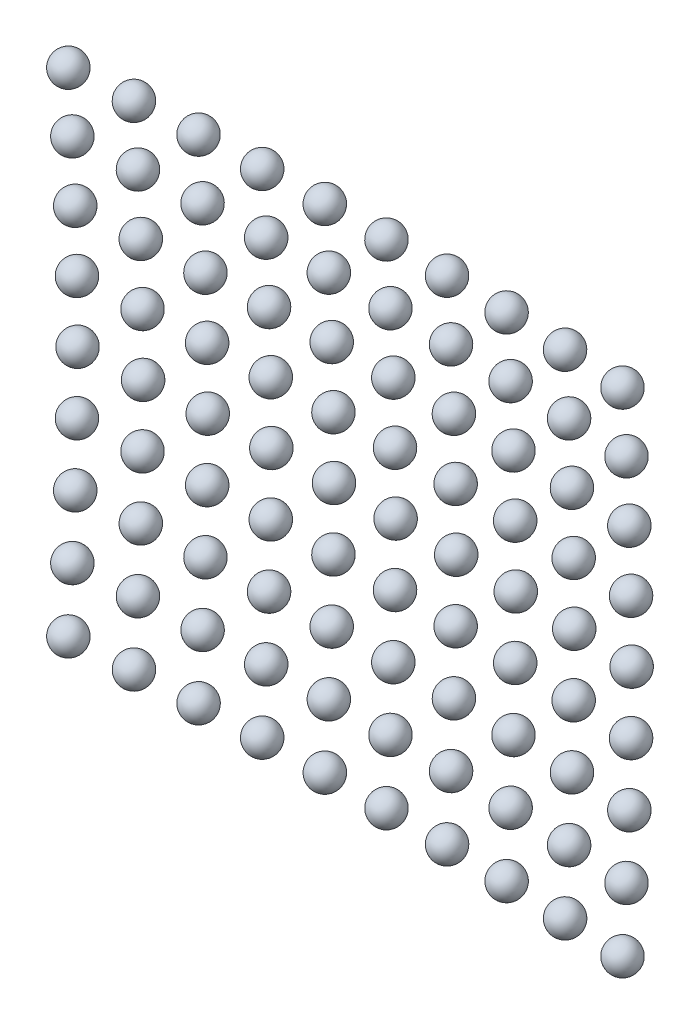
ISO-10303-21;
HEADER;
FILE_DESCRIPTION(('STEP AP214'),'2;1');
FILE_NAME('part.step','',(''),(''),'','','');
FILE_SCHEMA(('AUTOMOTIVE_DESIGN { 1 0 10303 214 1 1 1 1 }'));
ENDSEC;
DATA;
#1=APPLICATION_CONTEXT('core data for automotive mechanical design processes');
#2=APPLICATION_PROTOCOL_DEFINITION('international standard','automotive_design',2000,#1);
#3=PRODUCT_CONTEXT('',#1,'mechanical');
#4=PRODUCT('Part','Part','',(#3));
#5=PRODUCT_RELATED_PRODUCT_CATEGORY('part','',(#4));
#6=PRODUCT_DEFINITION_FORMATION('','',#4);
#7=PRODUCT_DEFINITION_CONTEXT('part definition',#1,'design');
#8=PRODUCT_DEFINITION('design','',#6,#7);
#9=PRODUCT_DEFINITION_SHAPE('','',#8);
#10=(LENGTH_UNIT() NAMED_UNIT(*) SI_UNIT(.MILLI.,.METRE.));
#11=(NAMED_UNIT(*) PLANE_ANGLE_UNIT() SI_UNIT($,.RADIAN.));
#12=(NAMED_UNIT(*) SI_UNIT($,.STERADIAN.) SOLID_ANGLE_UNIT());
#13=UNCERTAINTY_MEASURE_WITH_UNIT(LENGTH_MEASURE(1.E-05),#10,'distance_accuracy_value','');
#14=(GEOMETRIC_REPRESENTATION_CONTEXT(3) GLOBAL_UNCERTAINTY_ASSIGNED_CONTEXT((#13)) GLOBAL_UNIT_ASSIGNED_CONTEXT((#10,
#11,#12)) REPRESENTATION_CONTEXT('',''));
#15=CARTESIAN_POINT('',(0.,0.,0.));
#16=DIRECTION('',(0.,0.,1.));
#17=DIRECTION('',(1.,0.,0.));
#18=AXIS2_PLACEMENT_3D('',#15,#16,#17);
#19=CARTESIAN_POINT('',(8.00817179263602,-8.9214419487475,0.747647017793937));
#20=DIRECTION('',(0.,0.,-1.));
#21=DIRECTION('',(0.,-1.,0.));
#22=AXIS2_PLACEMENT_3D('',#19,#20,#21);
#23=SPHERICAL_SURFACE('',#22,0.5);
#24=CARTESIAN_POINT('',(8.00817179263602,-8.9214419487475,0.247647017793937));
#25=VERTEX_POINT('',#24);
#26=VERTEX_LOOP('',#25);
#27=FACE_BOUND('',#26,.T.);
#28=ADVANCED_FACE('F41',(#27),#23,.T.);
#29=CLOSED_SHELL('',(#28));
#30=MANIFOLD_SOLID_BREP('B2',#29);
#31=CARTESIAN_POINT('',(6.01259338943925,-8.9214419487475,0.615076387186788));
#32=DIRECTION('',(0.,0.,-1.));
#33=DIRECTION('',(0.,-1.,0.));
#34=AXIS2_PLACEMENT_3D('',#31,#32,#33);
#35=SPHERICAL_SURFACE('',#34,0.5);
#36=CARTESIAN_POINT('',(6.01259338943925,-8.9214419487475,0.115076387186788));
#37=VERTEX_POINT('',#36);
#38=VERTEX_LOOP('',#37);
#39=FACE_BOUND('',#38,.T.);
#40=ADVANCED_FACE('F61',(#39),#35,.T.);
#41=CLOSED_SHELL('',(#40));
#42=MANIFOLD_SOLID_BREP('B6',#41);
#43=CARTESIAN_POINT('',(4.01508925056326,-8.9214419487475,0.515651286844554));
#44=DIRECTION('',(0.,0.,-1.));
#45=DIRECTION('',(0.,-1.,0.));
#46=AXIS2_PLACEMENT_3D('',#43,#44,#45);
#47=SPHERICAL_SURFACE('',#46,0.5);
#48=CARTESIAN_POINT('',(4.01508925056326,-8.9214419487475,0.0156512868445537));
#49=VERTEX_POINT('',#48);
#50=VERTEX_LOOP('',#49);
#51=FACE_BOUND('',#50,.T.);
#52=ADVANCED_FACE('F81',(#51),#47,.T.);
#53=CLOSED_SHELL('',(#52));
#54=MANIFOLD_SOLID_BREP('B37',#53);
#55=CARTESIAN_POINT('',(2.01620986814937,-8.9214419487475,0.449399117329413));
#56=DIRECTION('',(0.,0.,-1.));
#57=DIRECTION('',(0.,-1.,0.));
#58=AXIS2_PLACEMENT_3D('',#55,#56,#57);
#59=SPHERICAL_SURFACE('',#58,0.5);
#60=CARTESIAN_POINT('',(2.01620986814937,-8.9214419487475,-0.0506008826705871));
#61=VERTEX_POINT('',#60);
#62=VERTEX_LOOP('',#61);
#63=FACE_BOUND('',#62,.T.);
#64=ADVANCED_FACE('F101',(#63),#59,.T.);
#65=CLOSED_SHELL('',(#64));
#66=MANIFOLD_SOLID_BREP('B57',#65);
#67=CARTESIAN_POINT('',(0.0165061133422777,-8.9214419487475,0.416338137075991));
#68=DIRECTION('',(0.,0.,-1.));
#69=DIRECTION('',(0.,-1.,0.));
#70=AXIS2_PLACEMENT_3D('',#67,#68,#69);
#71=SPHERICAL_SURFACE('',#70,0.5);
#72=CARTESIAN_POINT('',(0.0165061133422777,-8.9214419487475,-0.0836618629240086));
#73=VERTEX_POINT('',#72);
#74=VERTEX_LOOP('',#73);
#75=FACE_BOUND('',#74,.T.);
#76=ADVANCED_FACE('F121',(#75),#71,.T.);
#77=CLOSED_SHELL('',(#76));
#78=MANIFOLD_SOLID_BREP('B77',#77);
#79=CARTESIAN_POINT('',(-1.98347091552447,-8.9214419487475,0.416477457359412));
#80=DIRECTION('',(0.,0.,-1.));
#81=DIRECTION('',(0.,-1.,0.));
#82=AXIS2_PLACEMENT_3D('',#79,#80,#81);
#83=SPHERICAL_SURFACE('',#82,0.5);
#84=CARTESIAN_POINT('',(-1.98347091552447,-8.9214419487475,-0.0835225426405876));
#85=VERTEX_POINT('',#84);
#86=VERTEX_LOOP('',#85);
#87=FACE_BOUND('',#86,.T.);
#88=ADVANCED_FACE('F141',(#87),#83,.T.);
#89=CLOSED_SHELL('',(#88));
#90=MANIFOLD_SOLID_BREP('B97',#89);
#91=CARTESIAN_POINT('',(-3.98317004480583,-8.9214419487475,0.449817039784403));
#92=DIRECTION('',(0.,0.,-1.));
#93=DIRECTION('',(0.,-1.,0.));
#94=AXIS2_PLACEMENT_3D('',#91,#92,#93);
#95=SPHERICAL_SURFACE('',#94,0.5);
#96=CARTESIAN_POINT('',(-3.98317004480583,-8.9214419487475,-0.0501829602155971));
#97=VERTEX_POINT('',#96);
#98=VERTEX_LOOP('',#97);
#99=FACE_BOUND('',#98,.T.);
#100=ADVANCED_FACE('F161',(#99),#95,.T.);
#101=CLOSED_SHELL('',(#100));
#102=MANIFOLD_SOLID_BREP('B117',#101);
#103=CARTESIAN_POINT('',(-5.982040177443,-8.9214419487475,0.516347696295841));
#104=DIRECTION('',(0.,0.,-1.));
#105=DIRECTION('',(0.,-1.,0.));
#106=AXIS2_PLACEMENT_3D('',#103,#104,#105);
#107=SPHERICAL_SURFACE('',#106,0.5);
#108=CARTESIAN_POINT('',(-5.982040177443,-8.9214419487475,0.0163476962958405));
#109=VERTEX_POINT('',#108);
#110=VERTEX_LOOP('',#109);
#111=FACE_BOUND('',#110,.T.);
#112=ADVANCED_FACE('F181',(#111),#107,.T.);
#113=CLOSED_SHELL('',(#112));
#114=MANIFOLD_SOLID_BREP('B137',#113);
#115=CARTESIAN_POINT('',(-7.97953044484047,-8.9214419487475,0.616051091710923));
#116=DIRECTION('',(0.,0.,-1.));
#117=DIRECTION('',(0.,-1.,0.));
#118=AXIS2_PLACEMENT_3D('',#115,#116,#117);
#119=SPHERICAL_SURFACE('',#118,0.5);
#120=CARTESIAN_POINT('',(-7.97953044484047,-8.9214419487475,0.116051091710923));
#121=VERTEX_POINT('',#120);
#122=VERTEX_LOOP('',#121);
#123=FACE_BOUND('',#122,.T.);
#124=ADVANCED_FACE('F201',(#123),#119,.T.);
#125=CLOSED_SHELL('',(#124));
#126=MANIFOLD_SOLID_BREP('B157',#125);
#127=CARTESIAN_POINT('',(-9.97509035867965,-8.9214419487475,0.748899748772111));
#128=DIRECTION('',(0.,0.,-1.));
#129=DIRECTION('',(0.,-1.,0.));
#130=AXIS2_PLACEMENT_3D('',#127,#128,#129);
#131=SPHERICAL_SURFACE('',#130,0.5);
#132=CARTESIAN_POINT('',(-9.97509035867965,-8.9214419487475,0.248899748772111));
#133=VERTEX_POINT('',#132);
#134=VERTEX_LOOP('',#133);
#135=FACE_BOUND('',#134,.T.);
#136=ADVANCED_FACE('F221',(#135),#131,.T.);
#137=CLOSED_SHELL('',(#136));
#138=MANIFOLD_SOLID_BREP('B177',#137);
#139=CARTESIAN_POINT('',(8.00817179263602,-6.92569907133099,0.617666145492551));
#140=DIRECTION('',(0.,0.,-1.));
#141=DIRECTION('',(0.,-1.,0.));
#142=AXIS2_PLACEMENT_3D('',#139,#140,#141);
#143=SPHERICAL_SURFACE('',#142,0.5);
#144=CARTESIAN_POINT('',(8.00817179263602,-6.92569907133099,0.117666145492551));
#145=VERTEX_POINT('',#144);
#146=VERTEX_LOOP('',#145);
#147=FACE_BOUND('',#146,.T.);
#148=ADVANCED_FACE('F241',(#147),#143,.T.);
#149=CLOSED_SHELL('',(#148));
#150=MANIFOLD_SOLID_BREP('B197',#149);
#151=CARTESIAN_POINT('',(6.01259338943925,-6.92569907133099,0.485095514885403));
#152=DIRECTION('',(0.,0.,-1.));
#153=DIRECTION('',(0.,-1.,0.));
#154=AXIS2_PLACEMENT_3D('',#151,#152,#153);
#155=SPHERICAL_SURFACE('',#154,0.5);
#156=CARTESIAN_POINT('',(6.01259338943925,-6.92569907133099,-0.0149044851145972));
#157=VERTEX_POINT('',#156);
#158=VERTEX_LOOP('',#157);
#159=FACE_BOUND('',#158,.T.);
#160=ADVANCED_FACE('F261',(#159),#155,.T.);
#161=CLOSED_SHELL('',(#160));
#162=MANIFOLD_SOLID_BREP('B217',#161);
#163=CARTESIAN_POINT('',(4.01508925056326,-6.92569907133099,0.385670414543168));
#164=DIRECTION('',(0.,0.,-1.));
#165=DIRECTION('',(0.,-1.,0.));
#166=AXIS2_PLACEMENT_3D('',#163,#164,#165);
#167=SPHERICAL_SURFACE('',#166,0.5);
#168=CARTESIAN_POINT('',(4.01508925056326,-6.92569907133099,-0.114329585456832));
#169=VERTEX_POINT('',#168);
#170=VERTEX_LOOP('',#169);
#171=FACE_BOUND('',#170,.T.);
#172=ADVANCED_FACE('F281',(#171),#167,.T.);
#173=CLOSED_SHELL('',(#172));
#174=MANIFOLD_SOLID_BREP('B237',#173);
#175=CARTESIAN_POINT('',(2.01620986814937,-6.92569907133099,0.319418245028027));
#176=DIRECTION('',(0.,0.,-1.));
#177=DIRECTION('',(0.,-1.,0.));
#178=AXIS2_PLACEMENT_3D('',#175,#176,#177);
#179=SPHERICAL_SURFACE('',#178,0.5);
#180=CARTESIAN_POINT('',(2.01620986814937,-6.92569907133099,-0.180581754971973));
#181=VERTEX_POINT('',#180);
#182=VERTEX_LOOP('',#181);
#183=FACE_BOUND('',#182,.T.);
#184=ADVANCED_FACE('F301',(#183),#179,.T.);
#185=CLOSED_SHELL('',(#184));
#186=MANIFOLD_SOLID_BREP('B257',#185);
#187=CARTESIAN_POINT('',(0.0165061133422777,-6.92569907133099,0.286357264774606));
#188=DIRECTION('',(0.,0.,-1.));
#189=DIRECTION('',(0.,-1.,0.));
#190=AXIS2_PLACEMENT_3D('',#187,#188,#189);
#191=SPHERICAL_SURFACE('',#190,0.5);
#192=CARTESIAN_POINT('',(0.0165061133422777,-6.92569907133099,-0.213642735225394));
#193=VERTEX_POINT('',#192);
#194=VERTEX_LOOP('',#193);
#195=FACE_BOUND('',#194,.T.);
#196=ADVANCED_FACE('F321',(#195),#191,.T.);
#197=CLOSED_SHELL('',(#196));
#198=MANIFOLD_SOLID_BREP('B277',#197);
#199=CARTESIAN_POINT('',(-1.98347091552447,-6.92569907133099,0.286496585058027));
#200=DIRECTION('',(0.,0.,-1.));
#201=DIRECTION('',(0.,-1.,0.));
#202=AXIS2_PLACEMENT_3D('',#199,#200,#201);
#203=SPHERICAL_SURFACE('',#202,0.5);
#204=CARTESIAN_POINT('',(-1.98347091552447,-6.92569907133099,-0.213503414941973));
#205=VERTEX_POINT('',#204);
#206=VERTEX_LOOP('',#205);
#207=FACE_BOUND('',#206,.T.);
#208=ADVANCED_FACE('F341',(#207),#203,.T.);
#209=CLOSED_SHELL('',(#208));
#210=MANIFOLD_SOLID_BREP('B297',#209);
#211=CARTESIAN_POINT('',(-3.98317004480583,-6.92569907133099,0.319836167483017));
#212=DIRECTION('',(0.,0.,-1.));
#213=DIRECTION('',(0.,-1.,0.));
#214=AXIS2_PLACEMENT_3D('',#211,#212,#213);
#215=SPHERICAL_SURFACE('',#214,0.5);
#216=CARTESIAN_POINT('',(-3.98317004480583,-6.92569907133099,-0.180163832516983));
#217=VERTEX_POINT('',#216);
#218=VERTEX_LOOP('',#217);
#219=FACE_BOUND('',#218,.T.);
#220=ADVANCED_FACE('F361',(#219),#215,.T.);
#221=CLOSED_SHELL('',(#220));
#222=MANIFOLD_SOLID_BREP('B317',#221);
#223=CARTESIAN_POINT('',(-5.982040177443,-6.92569907133099,0.386366823994455));
#224=DIRECTION('',(0.,0.,-1.));
#225=DIRECTION('',(0.,-1.,0.));
#226=AXIS2_PLACEMENT_3D('',#223,#224,#225);
#227=SPHERICAL_SURFACE('',#226,0.5);
#228=CARTESIAN_POINT('',(-5.982040177443,-6.92569907133099,-0.113633176005545));
#229=VERTEX_POINT('',#228);
#230=VERTEX_LOOP('',#229);
#231=FACE_BOUND('',#230,.T.);
#232=ADVANCED_FACE('F381',(#231),#227,.T.);
#233=CLOSED_SHELL('',(#232));
#234=MANIFOLD_SOLID_BREP('B337',#233);
#235=CARTESIAN_POINT('',(-7.97953044484047,-6.92569907133099,0.486070219409537));
#236=DIRECTION('',(0.,0.,-1.));
#237=DIRECTION('',(0.,-1.,0.));
#238=AXIS2_PLACEMENT_3D('',#235,#236,#237);
#239=SPHERICAL_SURFACE('',#238,0.5);
#240=CARTESIAN_POINT('',(-7.97953044484047,-6.92569907133099,-0.0139297805904629));
#241=VERTEX_POINT('',#240);
#242=VERTEX_LOOP('',#241);
#243=FACE_BOUND('',#242,.T.);
#244=ADVANCED_FACE('F401',(#243),#239,.T.);
#245=CLOSED_SHELL('',(#244));
#246=MANIFOLD_SOLID_BREP('B357',#245);
#247=CARTESIAN_POINT('',(-9.97509035867965,-6.92569907133099,0.618918876470725));
#248=DIRECTION('',(0.,0.,-1.));
#249=DIRECTION('',(0.,-1.,0.));
#250=AXIS2_PLACEMENT_3D('',#247,#248,#249);
#251=SPHERICAL_SURFACE('',#250,0.5);
#252=CARTESIAN_POINT('',(-9.97509035867965,-6.92569907133099,0.118918876470725));
#253=VERTEX_POINT('',#252);
#254=VERTEX_LOOP('',#253);
#255=FACE_BOUND('',#254,.T.);
#256=ADVANCED_FACE('F421',(#255),#251,.T.);
#257=CLOSED_SHELL('',(#256));
#258=MANIFOLD_SOLID_BREP('B377',#257);
#259=CARTESIAN_POINT('',(8.00817179263602,-4.92788374246977,0.524829882696809));
#260=DIRECTION('',(0.,0.,-1.));
#261=DIRECTION('',(0.,-1.,0.));
#262=AXIS2_PLACEMENT_3D('',#259,#260,#261);
#263=SPHERICAL_SURFACE('',#262,0.5);
#264=CARTESIAN_POINT('',(8.00817179263602,-4.92788374246977,0.0248298826968087));
#265=VERTEX_POINT('',#264);
#266=VERTEX_LOOP('',#265);
#267=FACE_BOUND('',#266,.T.);
#268=ADVANCED_FACE('F441',(#267),#263,.T.);
#269=CLOSED_SHELL('',(#268));
#270=MANIFOLD_SOLID_BREP('B397',#269);
#271=CARTESIAN_POINT('',(6.01259338943925,-4.92788374246977,0.39225925208966));
#272=DIRECTION('',(0.,0.,-1.));
#273=DIRECTION('',(0.,-1.,0.));
#274=AXIS2_PLACEMENT_3D('',#271,#272,#273);
#275=SPHERICAL_SURFACE('',#274,0.5);
#276=CARTESIAN_POINT('',(6.01259338943925,-4.92788374246977,-0.10774074791034));
#277=VERTEX_POINT('',#276);
#278=VERTEX_LOOP('',#277);
#279=FACE_BOUND('',#278,.T.);
#280=ADVANCED_FACE('F461',(#279),#275,.T.);
#281=CLOSED_SHELL('',(#280));
#282=MANIFOLD_SOLID_BREP('B417',#281);
#283=CARTESIAN_POINT('',(4.01508925056326,-4.92788374246977,0.292834151747426));
#284=DIRECTION('',(0.,0.,-1.));
#285=DIRECTION('',(0.,-1.,0.));
#286=AXIS2_PLACEMENT_3D('',#283,#284,#285);
#287=SPHERICAL_SURFACE('',#286,0.5);
#288=CARTESIAN_POINT('',(4.01508925056326,-4.92788374246977,-0.207165848252574));
#289=VERTEX_POINT('',#288);
#290=VERTEX_LOOP('',#289);
#291=FACE_BOUND('',#290,.T.);
#292=ADVANCED_FACE('F481',(#291),#287,.T.);
#293=CLOSED_SHELL('',(#292));
#294=MANIFOLD_SOLID_BREP('B437',#293);
#295=CARTESIAN_POINT('',(2.01620986814937,-4.92788374246977,0.226581982232285));
#296=DIRECTION('',(0.,0.,-1.));
#297=DIRECTION('',(0.,-1.,0.));
#298=AXIS2_PLACEMENT_3D('',#295,#296,#297);
#299=SPHERICAL_SURFACE('',#298,0.5);
#300=CARTESIAN_POINT('',(2.01620986814937,-4.92788374246977,-0.273418017767715));
#301=VERTEX_POINT('',#300);
#302=VERTEX_LOOP('',#301);
#303=FACE_BOUND('',#302,.T.);
#304=ADVANCED_FACE('F501',(#303),#299,.T.);
#305=CLOSED_SHELL('',(#304));
#306=MANIFOLD_SOLID_BREP('B457',#305);
#307=CARTESIAN_POINT('',(0.0165061133422777,-4.92788374246977,0.193521001978863));
#308=DIRECTION('',(0.,0.,-1.));
#309=DIRECTION('',(0.,-1.,0.));
#310=AXIS2_PLACEMENT_3D('',#307,#308,#309);
#311=SPHERICAL_SURFACE('',#310,0.5);
#312=CARTESIAN_POINT('',(0.0165061133422777,-4.92788374246977,-0.306478998021137));
#313=VERTEX_POINT('',#312);
#314=VERTEX_LOOP('',#313);
#315=FACE_BOUND('',#314,.T.);
#316=ADVANCED_FACE('F521',(#315),#311,.T.);
#317=CLOSED_SHELL('',(#316));
#318=MANIFOLD_SOLID_BREP('B477',#317);
#319=CARTESIAN_POINT('',(-1.98347091552447,-4.92788374246977,0.193660322262284));
#320=DIRECTION('',(0.,0.,-1.));
#321=DIRECTION('',(0.,-1.,0.));
#322=AXIS2_PLACEMENT_3D('',#319,#320,#321);
#323=SPHERICAL_SURFACE('',#322,0.5);
#324=CARTESIAN_POINT('',(-1.98347091552447,-4.92788374246977,-0.306339677737716));
#325=VERTEX_POINT('',#324);
#326=VERTEX_LOOP('',#325);
#327=FACE_BOUND('',#326,.T.);
#328=ADVANCED_FACE('F541',(#327),#323,.T.);
#329=CLOSED_SHELL('',(#328));
#330=MANIFOLD_SOLID_BREP('B497',#329);
#331=CARTESIAN_POINT('',(-3.98317004480583,-4.92788374246977,0.226999904687275));
#332=DIRECTION('',(0.,0.,-1.));
#333=DIRECTION('',(0.,-1.,0.));
#334=AXIS2_PLACEMENT_3D('',#331,#332,#333);
#335=SPHERICAL_SURFACE('',#334,0.5);
#336=CARTESIAN_POINT('',(-3.98317004480583,-4.92788374246977,-0.273000095312725));
#337=VERTEX_POINT('',#336);
#338=VERTEX_LOOP('',#337);
#339=FACE_BOUND('',#338,.T.);
#340=ADVANCED_FACE('F561',(#339),#335,.T.);
#341=CLOSED_SHELL('',(#340));
#342=MANIFOLD_SOLID_BREP('B517',#341);
#343=CARTESIAN_POINT('',(-5.982040177443,-4.92788374246977,0.293530561198712));
#344=DIRECTION('',(0.,0.,-1.));
#345=DIRECTION('',(0.,-1.,0.));
#346=AXIS2_PLACEMENT_3D('',#343,#344,#345);
#347=SPHERICAL_SURFACE('',#346,0.5);
#348=CARTESIAN_POINT('',(-5.982040177443,-4.92788374246977,-0.206469438801288));
#349=VERTEX_POINT('',#348);
#350=VERTEX_LOOP('',#349);
#351=FACE_BOUND('',#350,.T.);
#352=ADVANCED_FACE('F581',(#351),#347,.T.);
#353=CLOSED_SHELL('',(#352));
#354=MANIFOLD_SOLID_BREP('B537',#353);
#355=CARTESIAN_POINT('',(-7.97953044484047,-4.92788374246977,0.393233956613795));
#356=DIRECTION('',(0.,0.,-1.));
#357=DIRECTION('',(0.,-1.,0.));
#358=AXIS2_PLACEMENT_3D('',#355,#356,#357);
#359=SPHERICAL_SURFACE('',#358,0.5);
#360=CARTESIAN_POINT('',(-7.97953044484047,-4.92788374246977,-0.106766043386205));
#361=VERTEX_POINT('',#360);
#362=VERTEX_LOOP('',#361);
#363=FACE_BOUND('',#362,.T.);
#364=ADVANCED_FACE('F601',(#363),#359,.T.);
#365=CLOSED_SHELL('',(#364));
#366=MANIFOLD_SOLID_BREP('B557',#365);
#367=CARTESIAN_POINT('',(-9.97509035867965,-4.92788374246977,0.526082613674983));
#368=DIRECTION('',(0.,0.,-1.));
#369=DIRECTION('',(0.,-1.,0.));
#370=AXIS2_PLACEMENT_3D('',#367,#368,#369);
#371=SPHERICAL_SURFACE('',#370,0.5);
#372=CARTESIAN_POINT('',(-9.97509035867965,-4.92788374246977,0.0260826136749828));
#373=VERTEX_POINT('',#372);
#374=VERTEX_LOOP('',#373);
#375=FACE_BOUND('',#374,.T.);
#376=ADVANCED_FACE('F621',(#375),#371,.T.);
#377=CLOSED_SHELL('',(#376));
#378=MANIFOLD_SOLID_BREP('B577',#377);
#379=CARTESIAN_POINT('',(8.00817179263602,-2.92868723472621,0.469170352076081));
#380=DIRECTION('',(0.,0.,-1.));
#381=DIRECTION('',(0.,-1.,0.));
#382=AXIS2_PLACEMENT_3D('',#379,#380,#381);
#383=SPHERICAL_SURFACE('',#382,0.5);
#384=CARTESIAN_POINT('',(8.00817179263602,-2.92868723472621,-0.0308296479239187));
#385=VERTEX_POINT('',#384);
#386=VERTEX_LOOP('',#385);
#387=FACE_BOUND('',#386,.T.);
#388=ADVANCED_FACE('F641',(#387),#383,.T.);
#389=CLOSED_SHELL('',(#388));
#390=MANIFOLD_SOLID_BREP('B597',#389);
#391=CARTESIAN_POINT('',(6.01259338943925,-2.92868723472621,0.336599721468933));
#392=DIRECTION('',(0.,0.,-1.));
#393=DIRECTION('',(0.,-1.,0.));
#394=AXIS2_PLACEMENT_3D('',#391,#392,#393);
#395=SPHERICAL_SURFACE('',#394,0.5);
#396=CARTESIAN_POINT('',(6.01259338943925,-2.92868723472621,-0.163400278531067));
#397=VERTEX_POINT('',#396);
#398=VERTEX_LOOP('',#397);
#399=FACE_BOUND('',#398,.T.);
#400=ADVANCED_FACE('F661',(#399),#395,.T.);
#401=CLOSED_SHELL('',(#400));
#402=MANIFOLD_SOLID_BREP('B617',#401);
#403=CARTESIAN_POINT('',(4.01508925056326,-2.92868723472621,0.237174621126698));
#404=DIRECTION('',(0.,0.,-1.));
#405=DIRECTION('',(0.,-1.,0.));
#406=AXIS2_PLACEMENT_3D('',#403,#404,#405);
#407=SPHERICAL_SURFACE('',#406,0.5);
#408=CARTESIAN_POINT('',(4.01508925056326,-2.92868723472621,-0.262825378873302));
#409=VERTEX_POINT('',#408);
#410=VERTEX_LOOP('',#409);
#411=FACE_BOUND('',#410,.T.);
#412=ADVANCED_FACE('F681',(#411),#407,.T.);
#413=CLOSED_SHELL('',(#412));
#414=MANIFOLD_SOLID_BREP('B637',#413);
#415=CARTESIAN_POINT('',(2.01620986814937,-2.92868723472621,0.170922451611557));
#416=DIRECTION('',(0.,0.,-1.));
#417=DIRECTION('',(0.,-1.,0.));
#418=AXIS2_PLACEMENT_3D('',#415,#416,#417);
#419=SPHERICAL_SURFACE('',#418,0.5);
#420=CARTESIAN_POINT('',(2.01620986814937,-2.92868723472621,-0.329077548388443));
#421=VERTEX_POINT('',#420);
#422=VERTEX_LOOP('',#421);
#423=FACE_BOUND('',#422,.T.);
#424=ADVANCED_FACE('F701',(#423),#419,.T.);
#425=CLOSED_SHELL('',(#424));
#426=MANIFOLD_SOLID_BREP('B657',#425);
#427=CARTESIAN_POINT('',(0.0165061133422777,-2.92868723472621,0.137861471358136));
#428=DIRECTION('',(0.,0.,-1.));
#429=DIRECTION('',(0.,-1.,0.));
#430=AXIS2_PLACEMENT_3D('',#427,#428,#429);
#431=SPHERICAL_SURFACE('',#430,0.5);
#432=CARTESIAN_POINT('',(0.0165061133422777,-2.92868723472621,-0.362138528641864));
#433=VERTEX_POINT('',#432);
#434=VERTEX_LOOP('',#433);
#435=FACE_BOUND('',#434,.T.);
#436=ADVANCED_FACE('F721',(#435),#431,.T.);
#437=CLOSED_SHELL('',(#436));
#438=MANIFOLD_SOLID_BREP('B677',#437);
#439=CARTESIAN_POINT('',(-1.98347091552447,-2.92868723472621,0.138000791641557));
#440=DIRECTION('',(0.,0.,-1.));
#441=DIRECTION('',(0.,-1.,0.));
#442=AXIS2_PLACEMENT_3D('',#439,#440,#441);
#443=SPHERICAL_SURFACE('',#442,0.5);
#444=CARTESIAN_POINT('',(-1.98347091552447,-2.92868723472621,-0.361999208358443));
#445=VERTEX_POINT('',#444);
#446=VERTEX_LOOP('',#445);
#447=FACE_BOUND('',#446,.T.);
#448=ADVANCED_FACE('F741',(#447),#443,.T.);
#449=CLOSED_SHELL('',(#448));
#450=MANIFOLD_SOLID_BREP('B697',#449);
#451=CARTESIAN_POINT('',(-3.98317004480583,-2.92868723472621,0.171340374066547));
#452=DIRECTION('',(0.,0.,-1.));
#453=DIRECTION('',(0.,-1.,0.));
#454=AXIS2_PLACEMENT_3D('',#451,#452,#453);
#455=SPHERICAL_SURFACE('',#454,0.5);
#456=CARTESIAN_POINT('',(-3.98317004480583,-2.92868723472621,-0.328659625933453));
#457=VERTEX_POINT('',#456);
#458=VERTEX_LOOP('',#457);
#459=FACE_BOUND('',#458,.T.);
#460=ADVANCED_FACE('F761',(#459),#455,.T.);
#461=CLOSED_SHELL('',(#460));
#462=MANIFOLD_SOLID_BREP('B717',#461);
#463=CARTESIAN_POINT('',(-5.982040177443,-2.92868723472621,0.237871030577985));
#464=DIRECTION('',(0.,0.,-1.));
#465=DIRECTION('',(0.,-1.,0.));
#466=AXIS2_PLACEMENT_3D('',#463,#464,#465);
#467=SPHERICAL_SURFACE('',#466,0.5);
#468=CARTESIAN_POINT('',(-5.982040177443,-2.92868723472621,-0.262128969422015));
#469=VERTEX_POINT('',#468);
#470=VERTEX_LOOP('',#469);
#471=FACE_BOUND('',#470,.T.);
#472=ADVANCED_FACE('F781',(#471),#467,.T.);
#473=CLOSED_SHELL('',(#472));
#474=MANIFOLD_SOLID_BREP('B737',#473);
#475=CARTESIAN_POINT('',(-7.97953044484047,-2.92868723472621,0.337574425993067));
#476=DIRECTION('',(0.,0.,-1.));
#477=DIRECTION('',(0.,-1.,0.));
#478=AXIS2_PLACEMENT_3D('',#475,#476,#477);
#479=SPHERICAL_SURFACE('',#478,0.5);
#480=CARTESIAN_POINT('',(-7.97953044484047,-2.92868723472621,-0.162425574006933));
#481=VERTEX_POINT('',#480);
#482=VERTEX_LOOP('',#481);
#483=FACE_BOUND('',#482,.T.);
#484=ADVANCED_FACE('F801',(#483),#479,.T.);
#485=CLOSED_SHELL('',(#484));
#486=MANIFOLD_SOLID_BREP('B757',#485);
#487=CARTESIAN_POINT('',(-9.97509035867965,-2.92868723472621,0.470423083054255));
#488=DIRECTION('',(0.,0.,-1.));
#489=DIRECTION('',(0.,-1.,0.));
#490=AXIS2_PLACEMENT_3D('',#487,#488,#489);
#491=SPHERICAL_SURFACE('',#490,0.5);
#492=CARTESIAN_POINT('',(-9.97509035867965,-2.92868723472621,-0.0295769169457447));
#493=VERTEX_POINT('',#492);
#494=VERTEX_LOOP('',#493);
#495=FACE_BOUND('',#494,.T.);
#496=ADVANCED_FACE('F821',(#495),#491,.T.);
#497=CLOSED_SHELL('',(#496));
#498=MANIFOLD_SOLID_BREP('B777',#497);
#499=CARTESIAN_POINT('',(8.00817179263602,-0.928801298570512,0.450706812620813));
#500=DIRECTION('',(0.,0.,-1.));
#501=DIRECTION('',(0.,-1.,0.));
#502=AXIS2_PLACEMENT_3D('',#499,#500,#501);
#503=SPHERICAL_SURFACE('',#502,0.5);
#504=CARTESIAN_POINT('',(8.00817179263602,-0.928801298570512,-0.0492931873791872));
#505=VERTEX_POINT('',#504);
#506=VERTEX_LOOP('',#505);
#507=FACE_BOUND('',#506,.T.);
#508=ADVANCED_FACE('F841',(#507),#503,.T.);
#509=CLOSED_SHELL('',(#508));
#510=MANIFOLD_SOLID_BREP('B797',#509);
#511=CARTESIAN_POINT('',(6.01259338943925,-0.928801298570512,0.318136182013664));
#512=DIRECTION('',(0.,0.,-1.));
#513=DIRECTION('',(0.,-1.,0.));
#514=AXIS2_PLACEMENT_3D('',#511,#512,#513);
#515=SPHERICAL_SURFACE('',#514,0.5);
#516=CARTESIAN_POINT('',(6.01259338943925,-0.928801298570512,-0.181863817986336));
#517=VERTEX_POINT('',#516);
#518=VERTEX_LOOP('',#517);
#519=FACE_BOUND('',#518,.T.);
#520=ADVANCED_FACE('F861',(#519),#515,.T.);
#521=CLOSED_SHELL('',(#520));
#522=MANIFOLD_SOLID_BREP('B817',#521);
#523=CARTESIAN_POINT('',(4.01508925056326,-0.928801298570512,0.21871108167143));
#524=DIRECTION('',(0.,0.,-1.));
#525=DIRECTION('',(0.,-1.,0.));
#526=AXIS2_PLACEMENT_3D('',#523,#524,#525);
#527=SPHERICAL_SURFACE('',#526,0.5);
#528=CARTESIAN_POINT('',(4.01508925056326,-0.928801298570512,-0.28128891832857));
#529=VERTEX_POINT('',#528);
#530=VERTEX_LOOP('',#529);
#531=FACE_BOUND('',#530,.T.);
#532=ADVANCED_FACE('F881',(#531),#527,.T.);
#533=CLOSED_SHELL('',(#532));
#534=MANIFOLD_SOLID_BREP('B837',#533);
#535=CARTESIAN_POINT('',(2.01620986814937,-0.928801298570512,0.152458912156289));
#536=DIRECTION('',(0.,0.,-1.));
#537=DIRECTION('',(0.,-1.,0.));
#538=AXIS2_PLACEMENT_3D('',#535,#536,#537);
#539=SPHERICAL_SURFACE('',#538,0.5);
#540=CARTESIAN_POINT('',(2.01620986814937,-0.928801298570512,-0.347541087843711));
#541=VERTEX_POINT('',#540);
#542=VERTEX_LOOP('',#541);
#543=FACE_BOUND('',#542,.T.);
#544=ADVANCED_FACE('F901',(#543),#539,.T.);
#545=CLOSED_SHELL('',(#544));
#546=MANIFOLD_SOLID_BREP('B857',#545);
#547=CARTESIAN_POINT('',(0.0165061133422777,-0.928801298570512,0.119397931902867));
#548=DIRECTION('',(0.,0.,-1.));
#549=DIRECTION('',(0.,-1.,0.));
#550=AXIS2_PLACEMENT_3D('',#547,#548,#549);
#551=SPHERICAL_SURFACE('',#550,0.5);
#552=CARTESIAN_POINT('',(0.0165061133422777,-0.928801298570512,-0.380602068097133));
#553=VERTEX_POINT('',#552);
#554=VERTEX_LOOP('',#553);
#555=FACE_BOUND('',#554,.T.);
#556=ADVANCED_FACE('F921',(#555),#551,.T.);
#557=CLOSED_SHELL('',(#556));
#558=MANIFOLD_SOLID_BREP('B877',#557);
#559=CARTESIAN_POINT('',(-1.98347091552447,-0.928801298570512,0.119537252186288));
#560=DIRECTION('',(0.,0.,-1.));
#561=DIRECTION('',(0.,-1.,0.));
#562=AXIS2_PLACEMENT_3D('',#559,#560,#561);
#563=SPHERICAL_SURFACE('',#562,0.5);
#564=CARTESIAN_POINT('',(-1.98347091552447,-0.928801298570512,-0.380462747813712));
#565=VERTEX_POINT('',#564);
#566=VERTEX_LOOP('',#565);
#567=FACE_BOUND('',#566,.T.);
#568=ADVANCED_FACE('F941',(#567),#563,.T.);
#569=CLOSED_SHELL('',(#568));
#570=MANIFOLD_SOLID_BREP('B897',#569);
#571=CARTESIAN_POINT('',(-3.98317004480583,-0.928801298570512,0.152876834611279));
#572=DIRECTION('',(0.,0.,-1.));
#573=DIRECTION('',(0.,-1.,0.));
#574=AXIS2_PLACEMENT_3D('',#571,#572,#573);
#575=SPHERICAL_SURFACE('',#574,0.5);
#576=CARTESIAN_POINT('',(-3.98317004480583,-0.928801298570512,-0.347123165388721));
#577=VERTEX_POINT('',#576);
#578=VERTEX_LOOP('',#577);
#579=FACE_BOUND('',#578,.T.);
#580=ADVANCED_FACE('F961',(#579),#575,.T.);
#581=CLOSED_SHELL('',(#580));
#582=MANIFOLD_SOLID_BREP('B917',#581);
#583=CARTESIAN_POINT('',(-5.982040177443,-0.928801298570512,0.219407491122717));
#584=DIRECTION('',(0.,0.,-1.));
#585=DIRECTION('',(0.,-1.,0.));
#586=AXIS2_PLACEMENT_3D('',#583,#584,#585);
#587=SPHERICAL_SURFACE('',#586,0.5);
#588=CARTESIAN_POINT('',(-5.982040177443,-0.928801298570512,-0.280592508877283));
#589=VERTEX_POINT('',#588);
#590=VERTEX_LOOP('',#589);
#591=FACE_BOUND('',#590,.T.);
#592=ADVANCED_FACE('F981',(#591),#587,.T.);
#593=CLOSED_SHELL('',(#592));
#594=MANIFOLD_SOLID_BREP('B937',#593);
#595=CARTESIAN_POINT('',(-7.97953044484047,-0.928801298570512,0.319110886537799));
#596=DIRECTION('',(0.,0.,-1.));
#597=DIRECTION('',(0.,-1.,0.));
#598=AXIS2_PLACEMENT_3D('',#595,#596,#597);
#599=SPHERICAL_SURFACE('',#598,0.5);
#600=CARTESIAN_POINT('',(-7.97953044484047,-0.928801298570512,-0.180889113462201));
#601=VERTEX_POINT('',#600);
#602=VERTEX_LOOP('',#601);
#603=FACE_BOUND('',#602,.T.);
#604=ADVANCED_FACE('F1001',(#603),#599,.T.);
#605=CLOSED_SHELL('',(#604));
#606=MANIFOLD_SOLID_BREP('B957',#605);
#607=CARTESIAN_POINT('',(-9.97509035867965,-0.928801298570512,0.451959543598987));
#608=DIRECTION('',(0.,0.,-1.));
#609=DIRECTION('',(0.,-1.,0.));
#610=AXIS2_PLACEMENT_3D('',#607,#608,#609);
#611=SPHERICAL_SURFACE('',#610,0.5);
#612=CARTESIAN_POINT('',(-9.97509035867965,-0.928801298570512,-0.0480404564010132));
#613=VERTEX_POINT('',#612);
#614=VERTEX_LOOP('',#613);
#615=FACE_BOUND('',#614,.T.);
#616=ADVANCED_FACE('F1021',(#615),#611,.T.);
#617=CLOSED_SHELL('',(#616));
#618=MANIFOLD_SOLID_BREP('B977',#617);
#619=CARTESIAN_POINT('',(8.00817179263602,1.07108207697542,0.469445652978698));
#620=DIRECTION('',(0.,0.,-1.));
#621=DIRECTION('',(0.,-1.,0.));
#622=AXIS2_PLACEMENT_3D('',#619,#620,#621);
#623=SPHERICAL_SURFACE('',#622,0.5);
#624=CARTESIAN_POINT('',(8.00817179263602,1.07108207697542,-0.0305543470213024));
#625=VERTEX_POINT('',#624);
#626=VERTEX_LOOP('',#625);
#627=FACE_BOUND('',#626,.T.);
#628=ADVANCED_FACE('F1041',(#627),#623,.T.);
#629=CLOSED_SHELL('',(#628));
#630=MANIFOLD_SOLID_BREP('B997',#629);
#631=CARTESIAN_POINT('',(6.01259338943925,1.07108207697542,0.336875022371549));
#632=DIRECTION('',(0.,0.,-1.));
#633=DIRECTION('',(0.,-1.,0.));
#634=AXIS2_PLACEMENT_3D('',#631,#632,#633);
#635=SPHERICAL_SURFACE('',#634,0.5);
#636=CARTESIAN_POINT('',(6.01259338943925,1.07108207697542,-0.163124977628451));
#637=VERTEX_POINT('',#636);
#638=VERTEX_LOOP('',#637);
#639=FACE_BOUND('',#638,.T.);
#640=ADVANCED_FACE('F1061',(#639),#635,.T.);
#641=CLOSED_SHELL('',(#640));
#642=MANIFOLD_SOLID_BREP('B1017',#641);
#643=CARTESIAN_POINT('',(4.01508925056326,1.07108207697542,0.237449922029314));
#644=DIRECTION('',(0.,0.,-1.));
#645=DIRECTION('',(0.,-1.,0.));
#646=AXIS2_PLACEMENT_3D('',#643,#644,#645);
#647=SPHERICAL_SURFACE('',#646,0.5);
#648=CARTESIAN_POINT('',(4.01508925056326,1.07108207697542,-0.262550077970686));
#649=VERTEX_POINT('',#648);
#650=VERTEX_LOOP('',#649);
#651=FACE_BOUND('',#650,.T.);
#652=ADVANCED_FACE('F1081',(#651),#647,.T.);
#653=CLOSED_SHELL('',(#652));
#654=MANIFOLD_SOLID_BREP('B1037',#653);
#655=CARTESIAN_POINT('',(2.01620986814937,1.07108207697542,0.171197752514174));
#656=DIRECTION('',(0.,0.,-1.));
#657=DIRECTION('',(0.,-1.,0.));
#658=AXIS2_PLACEMENT_3D('',#655,#656,#657);
#659=SPHERICAL_SURFACE('',#658,0.5);
#660=CARTESIAN_POINT('',(2.01620986814937,1.07108207697542,-0.328802247485826));
#661=VERTEX_POINT('',#660);
#662=VERTEX_LOOP('',#661);
#663=FACE_BOUND('',#662,.T.);
#664=ADVANCED_FACE('F1101',(#663),#659,.T.);
#665=CLOSED_SHELL('',(#664));
#666=MANIFOLD_SOLID_BREP('B1057',#665);
#667=CARTESIAN_POINT('',(0.0165061133422777,1.07108207697542,0.138136772260752));
#668=DIRECTION('',(0.,0.,-1.));
#669=DIRECTION('',(0.,-1.,0.));
#670=AXIS2_PLACEMENT_3D('',#667,#668,#669);
#671=SPHERICAL_SURFACE('',#670,0.5);
#672=CARTESIAN_POINT('',(0.0165061133422777,1.07108207697542,-0.361863227739248));
#673=VERTEX_POINT('',#672);
#674=VERTEX_LOOP('',#673);
#675=FACE_BOUND('',#674,.T.);
#676=ADVANCED_FACE('F1121',(#675),#671,.T.);
#677=CLOSED_SHELL('',(#676));
#678=MANIFOLD_SOLID_BREP('B1077',#677);
#679=CARTESIAN_POINT('',(-1.98347091552447,1.07108207697542,0.138276092544173));
#680=DIRECTION('',(0.,0.,-1.));
#681=DIRECTION('',(0.,-1.,0.));
#682=AXIS2_PLACEMENT_3D('',#679,#680,#681);
#683=SPHERICAL_SURFACE('',#682,0.5);
#684=CARTESIAN_POINT('',(-1.98347091552447,1.07108207697542,-0.361723907455827));
#685=VERTEX_POINT('',#684);
#686=VERTEX_LOOP('',#685);
#687=FACE_BOUND('',#686,.T.);
#688=ADVANCED_FACE('F1141',(#687),#683,.T.);
#689=CLOSED_SHELL('',(#688));
#690=MANIFOLD_SOLID_BREP('B1097',#689);
#691=CARTESIAN_POINT('',(-3.98317004480583,1.07108207697542,0.171615674969164));
#692=DIRECTION('',(0.,0.,-1.));
#693=DIRECTION('',(0.,-1.,0.));
#694=AXIS2_PLACEMENT_3D('',#691,#692,#693);
#695=SPHERICAL_SURFACE('',#694,0.5);
#696=CARTESIAN_POINT('',(-3.98317004480583,1.07108207697542,-0.328384325030836));
#697=VERTEX_POINT('',#696);
#698=VERTEX_LOOP('',#697);
#699=FACE_BOUND('',#698,.T.);
#700=ADVANCED_FACE('F1161',(#699),#695,.T.);
#701=CLOSED_SHELL('',(#700));
#702=MANIFOLD_SOLID_BREP('B1117',#701);
#703=CARTESIAN_POINT('',(-5.982040177443,1.07108207697542,0.238146331480601));
#704=DIRECTION('',(0.,0.,-1.));
#705=DIRECTION('',(0.,-1.,0.));
#706=AXIS2_PLACEMENT_3D('',#703,#704,#705);
#707=SPHERICAL_SURFACE('',#706,0.5);
#708=CARTESIAN_POINT('',(-5.982040177443,1.07108207697542,-0.261853668519399));
#709=VERTEX_POINT('',#708);
#710=VERTEX_LOOP('',#709);
#711=FACE_BOUND('',#710,.T.);
#712=ADVANCED_FACE('F1181',(#711),#707,.T.);
#713=CLOSED_SHELL('',(#712));
#714=MANIFOLD_SOLID_BREP('B1137',#713);
#715=CARTESIAN_POINT('',(-7.97953044484047,1.07108207697542,0.337849726895683));
#716=DIRECTION('',(0.,0.,-1.));
#717=DIRECTION('',(0.,-1.,0.));
#718=AXIS2_PLACEMENT_3D('',#715,#716,#717);
#719=SPHERICAL_SURFACE('',#718,0.5);
#720=CARTESIAN_POINT('',(-7.97953044484047,1.07108207697542,-0.162150273104317));
#721=VERTEX_POINT('',#720);
#722=VERTEX_LOOP('',#721);
#723=FACE_BOUND('',#722,.T.);
#724=ADVANCED_FACE('F1201',(#723),#719,.T.);
#725=CLOSED_SHELL('',(#724));
#726=MANIFOLD_SOLID_BREP('B1157',#725);
#727=CARTESIAN_POINT('',(-9.97509035867965,1.07108207697542,0.470698383956872));
#728=DIRECTION('',(0.,0.,-1.));
#729=DIRECTION('',(0.,-1.,0.));
#730=AXIS2_PLACEMENT_3D('',#727,#728,#729);
#731=SPHERICAL_SURFACE('',#730,0.5);
#732=CARTESIAN_POINT('',(-9.97509035867965,1.07108207697542,-0.0293016160431284));
#733=VERTEX_POINT('',#732);
#734=VERTEX_LOOP('',#733);
#735=FACE_BOUND('',#734,.T.);
#736=ADVANCED_FACE('F1221',(#735),#731,.T.);
#737=CLOSED_SHELL('',(#736));
#738=MANIFOLD_SOLID_BREP('B1177',#737);
#739=CARTESIAN_POINT('',(8.00817179263602,3.07027090377535,0.525380389244004));
#740=DIRECTION('',(0.,0.,-1.));
#741=DIRECTION('',(0.,-1.,0.));
#742=AXIS2_PLACEMENT_3D('',#739,#740,#741);
#743=SPHERICAL_SURFACE('',#742,0.5);
#744=CARTESIAN_POINT('',(8.00817179263602,3.07027090377535,0.0253803892440038));
#745=VERTEX_POINT('',#744);
#746=VERTEX_LOOP('',#745);
#747=FACE_BOUND('',#746,.T.);
#748=ADVANCED_FACE('F1241',(#747),#743,.T.);
#749=CLOSED_SHELL('',(#748));
#750=MANIFOLD_SOLID_BREP('B1197',#749);
#751=CARTESIAN_POINT('',(6.01259338943925,3.07027090377535,0.392809758636855));
#752=DIRECTION('',(0.,0.,-1.));
#753=DIRECTION('',(0.,-1.,0.));
#754=AXIS2_PLACEMENT_3D('',#751,#752,#753);
#755=SPHERICAL_SURFACE('',#754,0.5);
#756=CARTESIAN_POINT('',(6.01259338943925,3.07027090377535,-0.107190241363145));
#757=VERTEX_POINT('',#756);
#758=VERTEX_LOOP('',#757);
#759=FACE_BOUND('',#758,.T.);
#760=ADVANCED_FACE('F1261',(#759),#755,.T.);
#761=CLOSED_SHELL('',(#760));
#762=MANIFOLD_SOLID_BREP('B1217',#761);
#763=CARTESIAN_POINT('',(4.01508925056326,3.07027090377535,0.293384658294621));
#764=DIRECTION('',(0.,0.,-1.));
#765=DIRECTION('',(0.,-1.,0.));
#766=AXIS2_PLACEMENT_3D('',#763,#764,#765);
#767=SPHERICAL_SURFACE('',#766,0.5);
#768=CARTESIAN_POINT('',(4.01508925056326,3.07027090377535,-0.206615341705379));
#769=VERTEX_POINT('',#768);
#770=VERTEX_LOOP('',#769);
#771=FACE_BOUND('',#770,.T.);
#772=ADVANCED_FACE('F1281',(#771),#767,.T.);
#773=CLOSED_SHELL('',(#772));
#774=MANIFOLD_SOLID_BREP('B1237',#773);
#775=CARTESIAN_POINT('',(2.01620986814937,3.07027090377535,0.22713248877948));
#776=DIRECTION('',(0.,0.,-1.));
#777=DIRECTION('',(0.,-1.,0.));
#778=AXIS2_PLACEMENT_3D('',#775,#776,#777);
#779=SPHERICAL_SURFACE('',#778,0.5);
#780=CARTESIAN_POINT('',(2.01620986814937,3.07027090377535,-0.27286751122052));
#781=VERTEX_POINT('',#780);
#782=VERTEX_LOOP('',#781);
#783=FACE_BOUND('',#782,.T.);
#784=ADVANCED_FACE('F1301',(#783),#779,.T.);
#785=CLOSED_SHELL('',(#784));
#786=MANIFOLD_SOLID_BREP('B1257',#785);
#787=CARTESIAN_POINT('',(0.0165061133422777,3.07027090377535,0.194071508526058));
#788=DIRECTION('',(0.,0.,-1.));
#789=DIRECTION('',(0.,-1.,0.));
#790=AXIS2_PLACEMENT_3D('',#787,#788,#789);
#791=SPHERICAL_SURFACE('',#790,0.5);
#792=CARTESIAN_POINT('',(0.0165061133422777,3.07027090377535,-0.305928491473942));
#793=VERTEX_POINT('',#792);
#794=VERTEX_LOOP('',#793);
#795=FACE_BOUND('',#794,.T.);
#796=ADVANCED_FACE('F1321',(#795),#791,.T.);
#797=CLOSED_SHELL('',(#796));
#798=MANIFOLD_SOLID_BREP('B1277',#797);
#799=CARTESIAN_POINT('',(-1.98347091552447,3.07027090377535,0.194210828809479));
#800=DIRECTION('',(0.,0.,-1.));
#801=DIRECTION('',(0.,-1.,0.));
#802=AXIS2_PLACEMENT_3D('',#799,#800,#801);
#803=SPHERICAL_SURFACE('',#802,0.5);
#804=CARTESIAN_POINT('',(-1.98347091552447,3.07027090377535,-0.305789171190521));
#805=VERTEX_POINT('',#804);
#806=VERTEX_LOOP('',#805);
#807=FACE_BOUND('',#806,.T.);
#808=ADVANCED_FACE('F1341',(#807),#803,.T.);
#809=CLOSED_SHELL('',(#808));
#810=MANIFOLD_SOLID_BREP('B1297',#809);
#811=CARTESIAN_POINT('',(-3.98317004480583,3.07027090377535,0.22755041123447));
#812=DIRECTION('',(0.,0.,-1.));
#813=DIRECTION('',(0.,-1.,0.));
#814=AXIS2_PLACEMENT_3D('',#811,#812,#813);
#815=SPHERICAL_SURFACE('',#814,0.5);
#816=CARTESIAN_POINT('',(-3.98317004480583,3.07027090377535,-0.27244958876553));
#817=VERTEX_POINT('',#816);
#818=VERTEX_LOOP('',#817);
#819=FACE_BOUND('',#818,.T.);
#820=ADVANCED_FACE('F1361',(#819),#815,.T.);
#821=CLOSED_SHELL('',(#820));
#822=MANIFOLD_SOLID_BREP('B1317',#821);
#823=CARTESIAN_POINT('',(-5.982040177443,3.07027090377535,0.294081067745907));
#824=DIRECTION('',(0.,0.,-1.));
#825=DIRECTION('',(0.,-1.,0.));
#826=AXIS2_PLACEMENT_3D('',#823,#824,#825);
#827=SPHERICAL_SURFACE('',#826,0.5);
#828=CARTESIAN_POINT('',(-5.982040177443,3.07027090377535,-0.205918932254093));
#829=VERTEX_POINT('',#828);
#830=VERTEX_LOOP('',#829);
#831=FACE_BOUND('',#830,.T.);
#832=ADVANCED_FACE('F1381',(#831),#827,.T.);
#833=CLOSED_SHELL('',(#832));
#834=MANIFOLD_SOLID_BREP('B1337',#833);
#835=CARTESIAN_POINT('',(-7.97953044484047,3.07027090377535,0.39378446316099));
#836=DIRECTION('',(0.,0.,-1.));
#837=DIRECTION('',(0.,-1.,0.));
#838=AXIS2_PLACEMENT_3D('',#835,#836,#837);
#839=SPHERICAL_SURFACE('',#838,0.5);
#840=CARTESIAN_POINT('',(-7.97953044484047,3.07027090377535,-0.10621553683901));
#841=VERTEX_POINT('',#840);
#842=VERTEX_LOOP('',#841);
#843=FACE_BOUND('',#842,.T.);
#844=ADVANCED_FACE('F1401',(#843),#839,.T.);
#845=CLOSED_SHELL('',(#844));
#846=MANIFOLD_SOLID_BREP('B1357',#845);
#847=CARTESIAN_POINT('',(-9.97509035867965,3.07027090377535,0.526633120222178));
#848=DIRECTION('',(0.,0.,-1.));
#849=DIRECTION('',(0.,-1.,0.));
#850=AXIS2_PLACEMENT_3D('',#847,#848,#849);
#851=SPHERICAL_SURFACE('',#850,0.5);
#852=CARTESIAN_POINT('',(-9.97509035867965,3.07027090377535,0.0266331202221778));
#853=VERTEX_POINT('',#852);
#854=VERTEX_LOOP('',#853);
#855=FACE_BOUND('',#854,.T.);
#856=ADVANCED_FACE('F1421',(#855),#851,.T.);
#857=CLOSED_SHELL('',(#856));
#858=MANIFOLD_SOLID_BREP('B1377',#857);
#859=CARTESIAN_POINT('',(8.00817179263602,5.06807343401705,0.618491667201237));
#860=DIRECTION('',(0.,0.,-1.));
#861=DIRECTION('',(0.,-1.,0.));
#862=AXIS2_PLACEMENT_3D('',#859,#860,#861);
#863=SPHERICAL_SURFACE('',#862,0.5);
#864=CARTESIAN_POINT('',(8.00817179263602,5.06807343401705,0.118491667201237));
#865=VERTEX_POINT('',#864);
#866=VERTEX_LOOP('',#865);
#867=FACE_BOUND('',#866,.T.);
#868=ADVANCED_FACE('F1441',(#867),#863,.T.);
#869=CLOSED_SHELL('',(#868));
#870=MANIFOLD_SOLID_BREP('B1397',#869);
#871=CARTESIAN_POINT('',(6.01259338943925,5.06807343401705,0.485921036594089));
#872=DIRECTION('',(0.,0.,-1.));
#873=DIRECTION('',(0.,-1.,0.));
#874=AXIS2_PLACEMENT_3D('',#871,#872,#873);
#875=SPHERICAL_SURFACE('',#874,0.5);
#876=CARTESIAN_POINT('',(6.01259338943925,5.06807343401705,-0.0140789634059111));
#877=VERTEX_POINT('',#876);
#878=VERTEX_LOOP('',#877);
#879=FACE_BOUND('',#878,.T.);
#880=ADVANCED_FACE('F1461',(#879),#875,.T.);
#881=CLOSED_SHELL('',(#880));
#882=MANIFOLD_SOLID_BREP('B1417',#881);
#883=CARTESIAN_POINT('',(4.01508925056326,5.06807343401705,0.386495936251854));
#884=DIRECTION('',(0.,0.,-1.));
#885=DIRECTION('',(0.,-1.,0.));
#886=AXIS2_PLACEMENT_3D('',#883,#884,#885);
#887=SPHERICAL_SURFACE('',#886,0.5);
#888=CARTESIAN_POINT('',(4.01508925056326,5.06807343401705,-0.113504063748146));
#889=VERTEX_POINT('',#888);
#890=VERTEX_LOOP('',#889);
#891=FACE_BOUND('',#890,.T.);
#892=ADVANCED_FACE('F1481',(#891),#887,.T.);
#893=CLOSED_SHELL('',(#892));
#894=MANIFOLD_SOLID_BREP('B1437',#893);
#895=CARTESIAN_POINT('',(2.01620986814937,5.06807343401705,0.320243766736713));
#896=DIRECTION('',(0.,0.,-1.));
#897=DIRECTION('',(0.,-1.,0.));
#898=AXIS2_PLACEMENT_3D('',#895,#896,#897);
#899=SPHERICAL_SURFACE('',#898,0.5);
#900=CARTESIAN_POINT('',(2.01620986814937,5.06807343401705,-0.179756233263287));
#901=VERTEX_POINT('',#900);
#902=VERTEX_LOOP('',#901);
#903=FACE_BOUND('',#902,.T.);
#904=ADVANCED_FACE('F1501',(#903),#899,.T.);
#905=CLOSED_SHELL('',(#904));
#906=MANIFOLD_SOLID_BREP('B1457',#905);
#907=CARTESIAN_POINT('',(0.0165061133422777,5.06807343401705,0.287182786483292));
#908=DIRECTION('',(0.,0.,-1.));
#909=DIRECTION('',(0.,-1.,0.));
#910=AXIS2_PLACEMENT_3D('',#907,#908,#909);
#911=SPHERICAL_SURFACE('',#910,0.5);
#912=CARTESIAN_POINT('',(0.0165061133422777,5.06807343401705,-0.212817213516708));
#913=VERTEX_POINT('',#912);
#914=VERTEX_LOOP('',#913);
#915=FACE_BOUND('',#914,.T.);
#916=ADVANCED_FACE('F1521',(#915),#911,.T.);
#917=CLOSED_SHELL('',(#916));
#918=MANIFOLD_SOLID_BREP('B1477',#917);
#919=CARTESIAN_POINT('',(-1.98347091552447,5.06807343401705,0.287322106766713));
#920=DIRECTION('',(0.,0.,-1.));
#921=DIRECTION('',(0.,-1.,0.));
#922=AXIS2_PLACEMENT_3D('',#919,#920,#921);
#923=SPHERICAL_SURFACE('',#922,0.5);
#924=CARTESIAN_POINT('',(-1.98347091552447,5.06807343401705,-0.212677893233287));
#925=VERTEX_POINT('',#924);
#926=VERTEX_LOOP('',#925);
#927=FACE_BOUND('',#926,.T.);
#928=ADVANCED_FACE('F1541',(#927),#923,.T.);
#929=CLOSED_SHELL('',(#928));
#930=MANIFOLD_SOLID_BREP('B1497',#929);
#931=CARTESIAN_POINT('',(-3.98317004480583,5.06807343401705,0.320661689191703));
#932=DIRECTION('',(0.,0.,-1.));
#933=DIRECTION('',(0.,-1.,0.));
#934=AXIS2_PLACEMENT_3D('',#931,#932,#933);
#935=SPHERICAL_SURFACE('',#934,0.5);
#936=CARTESIAN_POINT('',(-3.98317004480583,5.06807343401705,-0.179338310808297));
#937=VERTEX_POINT('',#936);
#938=VERTEX_LOOP('',#937);
#939=FACE_BOUND('',#938,.T.);
#940=ADVANCED_FACE('F1561',(#939),#935,.T.);
#941=CLOSED_SHELL('',(#940));
#942=MANIFOLD_SOLID_BREP('B1517',#941);
#943=CARTESIAN_POINT('',(-5.982040177443,5.06807343401705,0.387192345703141));
#944=DIRECTION('',(0.,0.,-1.));
#945=DIRECTION('',(0.,-1.,0.));
#946=AXIS2_PLACEMENT_3D('',#943,#944,#945);
#947=SPHERICAL_SURFACE('',#946,0.5);
#948=CARTESIAN_POINT('',(-5.982040177443,5.06807343401705,-0.112807654296859));
#949=VERTEX_POINT('',#948);
#950=VERTEX_LOOP('',#949);
#951=FACE_BOUND('',#950,.T.);
#952=ADVANCED_FACE('F1581',(#951),#947,.T.);
#953=CLOSED_SHELL('',(#952));
#954=MANIFOLD_SOLID_BREP('B1537',#953);
#955=CARTESIAN_POINT('',(-7.97953044484047,5.06807343401705,0.486895741118223));
#956=DIRECTION('',(0.,0.,-1.));
#957=DIRECTION('',(0.,-1.,0.));
#958=AXIS2_PLACEMENT_3D('',#955,#956,#957);
#959=SPHERICAL_SURFACE('',#958,0.5);
#960=CARTESIAN_POINT('',(-7.97953044484047,5.06807343401705,-0.0131042588817768));
#961=VERTEX_POINT('',#960);
#962=VERTEX_LOOP('',#961);
#963=FACE_BOUND('',#962,.T.);
#964=ADVANCED_FACE('F1601',(#963),#959,.T.);
#965=CLOSED_SHELL('',(#964));
#966=MANIFOLD_SOLID_BREP('B1557',#965);
#967=CARTESIAN_POINT('',(-9.97509035867965,5.06807343401705,0.619744398179411));
#968=DIRECTION('',(0.,0.,-1.));
#969=DIRECTION('',(0.,-1.,0.));
#970=AXIS2_PLACEMENT_3D('',#967,#968,#969);
#971=SPHERICAL_SURFACE('',#970,0.5);
#972=CARTESIAN_POINT('',(-9.97509035867965,5.06807343401705,0.119744398179411));
#973=VERTEX_POINT('',#972);
#974=VERTEX_LOOP('',#973);
#975=FACE_BOUND('',#974,.T.);
#976=ADVANCED_FACE('F1621',(#975),#971,.T.);
#977=CLOSED_SHELL('',(#976));
#978=MANIFOLD_SOLID_BREP('B1577',#977);
#979=CARTESIAN_POINT('',(8.00817179263602,7.06379839956644,0.74874726902184));
#980=DIRECTION('',(0.,0.,-1.));
#981=DIRECTION('',(0.,-1.,0.));
#982=AXIS2_PLACEMENT_3D('',#979,#980,#981);
#983=SPHERICAL_SURFACE('',#982,0.5);
#984=CARTESIAN_POINT('',(8.00817179263602,7.06379839956644,0.24874726902184));
#985=VERTEX_POINT('',#984);
#986=VERTEX_LOOP('',#985);
#987=FACE_BOUND('',#986,.T.);
#988=ADVANCED_FACE('F1641',(#987),#983,.T.);
#989=CLOSED_SHELL('',(#988));
#990=MANIFOLD_SOLID_BREP('B1597',#989);
#991=CARTESIAN_POINT('',(6.01259338943925,7.06379839956644,0.616176638414692));
#992=DIRECTION('',(0.,0.,-1.));
#993=DIRECTION('',(0.,-1.,0.));
#994=AXIS2_PLACEMENT_3D('',#991,#992,#993);
#995=SPHERICAL_SURFACE('',#994,0.5);
#996=CARTESIAN_POINT('',(6.01259338943925,7.06379839956644,0.116176638414692));
#997=VERTEX_POINT('',#996);
#998=VERTEX_LOOP('',#997);
#999=FACE_BOUND('',#998,.T.);
#1000=ADVANCED_FACE('F1661',(#999),#995,.T.);
#1001=CLOSED_SHELL('',(#1000));
#1002=MANIFOLD_SOLID_BREP('B1617',#1001);
#1003=CARTESIAN_POINT('',(4.01508925056326,7.06379839956644,0.516751538072457));
#1004=DIRECTION('',(0.,0.,-1.));
#1005=DIRECTION('',(0.,-1.,0.));
#1006=AXIS2_PLACEMENT_3D('',#1003,#1004,#1005);
#1007=SPHERICAL_SURFACE('',#1006,0.5);
#1008=CARTESIAN_POINT('',(4.01508925056326,7.06379839956644,0.0167515380724572));
#1009=VERTEX_POINT('',#1008);
#1010=VERTEX_LOOP('',#1009);
#1011=FACE_BOUND('',#1010,.T.);
#1012=ADVANCED_FACE('F1681',(#1011),#1007,.T.);
#1013=CLOSED_SHELL('',(#1012));
#1014=MANIFOLD_SOLID_BREP('B1637',#1013);
#1015=CARTESIAN_POINT('',(2.01620986814937,7.06379839956644,0.450499368557316));
#1016=DIRECTION('',(0.,0.,-1.));
#1017=DIRECTION('',(0.,-1.,0.));
#1018=AXIS2_PLACEMENT_3D('',#1015,#1016,#1017);
#1019=SPHERICAL_SURFACE('',#1018,0.5);
#1020=CARTESIAN_POINT('',(2.01620986814937,7.06379839956644,-0.0495006314426836));
#1021=VERTEX_POINT('',#1020);
#1022=VERTEX_LOOP('',#1021);
#1023=FACE_BOUND('',#1022,.T.);
#1024=ADVANCED_FACE('F1701',(#1023),#1019,.T.);
#1025=CLOSED_SHELL('',(#1024));
#1026=MANIFOLD_SOLID_BREP('B1657',#1025);
#1027=CARTESIAN_POINT('',(0.0165061133422777,7.06379839956644,0.417438388303895));
#1028=DIRECTION('',(0.,0.,-1.));
#1029=DIRECTION('',(0.,-1.,0.));
#1030=AXIS2_PLACEMENT_3D('',#1027,#1028,#1029);
#1031=SPHERICAL_SURFACE('',#1030,0.5);
#1032=CARTESIAN_POINT('',(0.0165061133422777,7.06379839956644,-0.0825616116961051));
#1033=VERTEX_POINT('',#1032);
#1034=VERTEX_LOOP('',#1033);
#1035=FACE_BOUND('',#1034,.T.);
#1036=ADVANCED_FACE('F1721',(#1035),#1031,.T.);
#1037=CLOSED_SHELL('',(#1036));
#1038=MANIFOLD_SOLID_BREP('B1677',#1037);
#1039=CARTESIAN_POINT('',(-1.98347091552447,7.06379839956644,0.417577708587316));
#1040=DIRECTION('',(0.,0.,-1.));
#1041=DIRECTION('',(0.,-1.,0.));
#1042=AXIS2_PLACEMENT_3D('',#1039,#1040,#1041);
#1043=SPHERICAL_SURFACE('',#1042,0.5);
#1044=CARTESIAN_POINT('',(-1.98347091552447,7.06379839956644,-0.0824222914126841));
#1045=VERTEX_POINT('',#1044);
#1046=VERTEX_LOOP('',#1045);
#1047=FACE_BOUND('',#1046,.T.);
#1048=ADVANCED_FACE('F1741',(#1047),#1043,.T.);
#1049=CLOSED_SHELL('',(#1048));
#1050=MANIFOLD_SOLID_BREP('B1697',#1049);
#1051=CARTESIAN_POINT('',(-3.98317004480583,7.06379839956644,0.450917291012306));
#1052=DIRECTION('',(0.,0.,-1.));
#1053=DIRECTION('',(0.,-1.,0.));
#1054=AXIS2_PLACEMENT_3D('',#1051,#1052,#1053);
#1055=SPHERICAL_SURFACE('',#1054,0.5);
#1056=CARTESIAN_POINT('',(-3.98317004480583,7.06379839956644,-0.0490827089876936));
#1057=VERTEX_POINT('',#1056);
#1058=VERTEX_LOOP('',#1057);
#1059=FACE_BOUND('',#1058,.T.);
#1060=ADVANCED_FACE('F1761',(#1059),#1055,.T.);
#1061=CLOSED_SHELL('',(#1060));
#1062=MANIFOLD_SOLID_BREP('B1717',#1061);
#1063=CARTESIAN_POINT('',(-5.982040177443,7.06379839956644,0.517447947523744));
#1064=DIRECTION('',(0.,0.,-1.));
#1065=DIRECTION('',(0.,-1.,0.));
#1066=AXIS2_PLACEMENT_3D('',#1063,#1064,#1065);
#1067=SPHERICAL_SURFACE('',#1066,0.5);
#1068=CARTESIAN_POINT('',(-5.982040177443,7.06379839956644,0.017447947523744));
#1069=VERTEX_POINT('',#1068);
#1070=VERTEX_LOOP('',#1069);
#1071=FACE_BOUND('',#1070,.T.);
#1072=ADVANCED_FACE('F1781',(#1071),#1067,.T.);
#1073=CLOSED_SHELL('',(#1072));
#1074=MANIFOLD_SOLID_BREP('B1737',#1073);
#1075=CARTESIAN_POINT('',(-7.97953044484047,7.06379839956644,0.617151342938826));
#1076=DIRECTION('',(0.,0.,-1.));
#1077=DIRECTION('',(0.,-1.,0.));
#1078=AXIS2_PLACEMENT_3D('',#1075,#1076,#1077);
#1079=SPHERICAL_SURFACE('',#1078,0.5);
#1080=CARTESIAN_POINT('',(-7.97953044484047,7.06379839956644,0.117151342938826));
#1081=VERTEX_POINT('',#1080);
#1082=VERTEX_LOOP('',#1081);
#1083=FACE_BOUND('',#1082,.T.);
#1084=ADVANCED_FACE('F1800',(#1083),#1079,.T.);
#1085=CLOSED_SHELL('',(#1084));
#1086=MANIFOLD_SOLID_BREP('B1757',#1085);
#1087=CARTESIAN_POINT('',(-9.97509035867964,7.06379839956644,0.75));
#1088=DIRECTION('',(0.,0.,-1.));
#1089=DIRECTION('',(0.,-1.,0.));
#1090=AXIS2_PLACEMENT_3D('',#1087,#1088,#1089);
#1091=SPHERICAL_SURFACE('',#1090,0.5);
#1092=CARTESIAN_POINT('',(-9.97509035867964,7.06379839956644,0.25));
#1093=VERTEX_POINT('',#1092);
#1094=VERTEX_LOOP('',#1093);
#1095=FACE_BOUND('',#1094,.T.);
#1096=ADVANCED_FACE('F1814',(#1095),#1091,.T.);
#1097=CLOSED_SHELL('',(#1096));
#1098=MANIFOLD_SOLID_BREP('B1777',#1097);
#1099=ADVANCED_BREP_SHAPE_REPRESENTATION('',(#18,#30,#42,#54,#66,#78,#90,#102,#114,#126,#138,
#150,#162,#174,#186,#198,#210,#222,#234,#246,#258,#270,#282,#294,#306,#318,#330,#342,#354,#366,
#378,#390,#402,#414,#426,#438,#450,#462,#474,#486,#498,#510,#522,#534,#546,#558,#570,#582,#594,
#606,#618,#630,#642,#654,#666,#678,#690,#702,#714,#726,#738,#750,#762,#774,#786,#798,#810,#822,
#834,#846,#858,#870,#882,#894,#906,#918,#930,#942,#954,#966,#978,#990,#1002,#1014,#1026,#1038,
#1050,#1062,#1074,#1086,#1098),#14);
#1100=SHAPE_DEFINITION_REPRESENTATION(#9,#1099);
ENDSEC;
END-ISO-10303-21;
